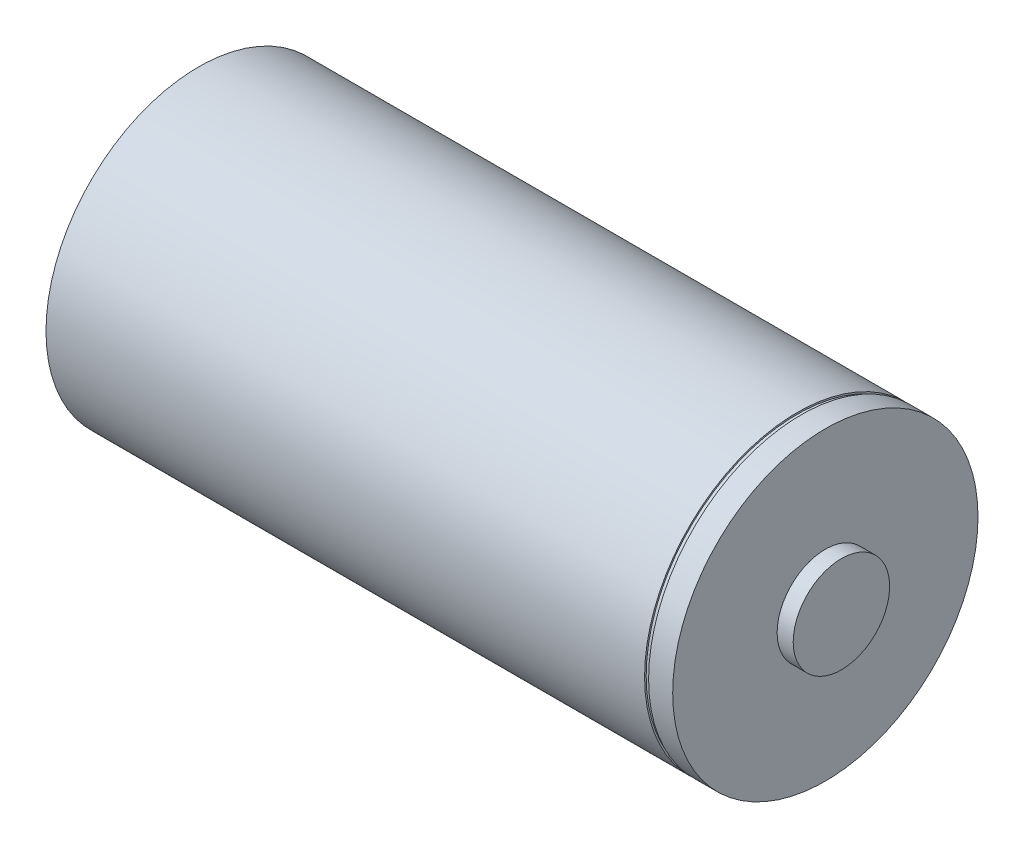
ISO-10303-21;
HEADER;
FILE_DESCRIPTION(('STEP AP214'),'2;1');
FILE_NAME('part.step','',(''),(''),'','','');
FILE_SCHEMA(('AUTOMOTIVE_DESIGN { 1 0 10303 214 1 1 1 1 }'));
ENDSEC;
DATA;
#1=APPLICATION_CONTEXT('core data for automotive mechanical design processes');
#2=APPLICATION_PROTOCOL_DEFINITION('international standard','automotive_design',2000,#1);
#3=PRODUCT_CONTEXT('',#1,'mechanical');
#4=PRODUCT('Part','Part','',(#3));
#5=PRODUCT_RELATED_PRODUCT_CATEGORY('part','',(#4));
#6=PRODUCT_DEFINITION_FORMATION('','',#4);
#7=PRODUCT_DEFINITION_CONTEXT('part definition',#1,'design');
#8=PRODUCT_DEFINITION('design','',#6,#7);
#9=PRODUCT_DEFINITION_SHAPE('','',#8);
#10=(LENGTH_UNIT() NAMED_UNIT(*) SI_UNIT(.MILLI.,.METRE.));
#11=(NAMED_UNIT(*) PLANE_ANGLE_UNIT() SI_UNIT($,.RADIAN.));
#12=(NAMED_UNIT(*) SI_UNIT($,.STERADIAN.) SOLID_ANGLE_UNIT());
#13=UNCERTAINTY_MEASURE_WITH_UNIT(LENGTH_MEASURE(1.E-05),#10,'distance_accuracy_value','');
#14=(GEOMETRIC_REPRESENTATION_CONTEXT(3) GLOBAL_UNCERTAINTY_ASSIGNED_CONTEXT((#13)) GLOBAL_UNIT_ASSIGNED_CONTEXT((#10,
#11,#12)) REPRESENTATION_CONTEXT('',''));
#15=CARTESIAN_POINT('',(0.,0.,0.));
#16=DIRECTION('',(0.,0.,1.));
#17=DIRECTION('',(1.,0.,0.));
#18=AXIS2_PLACEMENT_3D('',#15,#16,#17);
#19=CARTESIAN_POINT('',(0.,0.,0.));
#20=DIRECTION('',(-1.,0.,0.));
#21=DIRECTION('',(0.,0.,1.00000000000001));
#22=AXIS2_PLACEMENT_3D('',#19,#20,#21);
#23=CYLINDRICAL_SURFACE('',#22,19.);
#24=CARTESIAN_POINT('',(78.,0.,0.));
#25=DIRECTION('',(-1.,0.,0.));
#26=DIRECTION('',(0.,0.,1.00000000000001));
#27=AXIS2_PLACEMENT_3D('',#24,#25,#26);
#28=CIRCLE('',#27,19.);
#29=CARTESIAN_POINT('',(78.,0.,19.0000000000002));
#30=VERTEX_POINT('',#29);
#31=EDGE_CURVE('E44',#30,#30,#28,.T.);
#32=ORIENTED_EDGE('',*,*,#31,.T.);
#33=EDGE_LOOP('',(#32));
#34=FACE_BOUND('',#33,.T.);
#35=CARTESIAN_POINT('',(75.,0.,0.));
#36=DIRECTION('',(-1.,0.,0.));
#37=DIRECTION('',(0.,0.,1.00000000000001));
#38=AXIS2_PLACEMENT_3D('',#35,#36,#37);
#39=CIRCLE('',#38,19.);
#40=CARTESIAN_POINT('',(75.,0.,19.0000000000002));
#41=VERTEX_POINT('',#40);
#42=EDGE_CURVE('E70',#41,#41,#39,.T.);
#43=ORIENTED_EDGE('',*,*,#42,.F.);
#44=EDGE_LOOP('',(#43));
#45=FACE_BOUND('',#44,.T.);
#46=ADVANCED_FACE('F36',(#34,#45),#23,.T.);
#47=CARTESIAN_POINT('',(77.9999999999999,19.0000000000002,0.));
#48=DIRECTION('',(-1.,0.,0.));
#49=DIRECTION('',(0.,0.,1.00000000000001));
#50=AXIS2_PLACEMENT_3D('',#47,#48,#49);
#51=PLANE('',#50);
#52=ORIENTED_EDGE('',*,*,#31,.F.);
#53=EDGE_LOOP('',(#52));
#54=FACE_BOUND('',#53,.T.);
#55=CARTESIAN_POINT('',(78.,0.,0.));
#56=DIRECTION('',(-1.,0.,0.));
#57=DIRECTION('',(0.,0.,1.00000000000001));
#58=AXIS2_PLACEMENT_3D('',#55,#56,#57);
#59=CIRCLE('',#58,6.);
#60=CARTESIAN_POINT('',(78.,0.,6.00000000000005));
#61=VERTEX_POINT('',#60);
#62=EDGE_CURVE('E50',#61,#61,#59,.T.);
#63=ORIENTED_EDGE('',*,*,#62,.T.);
#64=EDGE_LOOP('',(#63));
#65=FACE_BOUND('',#64,.T.);
#66=ADVANCED_FACE('F99',(#54,#65),#51,.F.);
#67=CARTESIAN_POINT('',(0.,0.,0.));
#68=DIRECTION('',(-1.,0.,0.));
#69=DIRECTION('',(0.,0.,1.00000000000001));
#70=AXIS2_PLACEMENT_3D('',#67,#68,#69);
#71=CYLINDRICAL_SURFACE('',#70,6.);
#72=ORIENTED_EDGE('',*,*,#62,.F.);
#73=EDGE_LOOP('',(#72));
#74=FACE_BOUND('',#73,.T.);
#75=CARTESIAN_POINT('',(80.,-1.10588621593521E-13,0.));
#76=DIRECTION('',(-1.,0.,0.));
#77=DIRECTION('',(0.,0.,1.00000000000001));
#78=AXIS2_PLACEMENT_3D('',#75,#76,#77);
#79=CIRCLE('',#78,6.);
#80=CARTESIAN_POINT('',(80.,-1.10921688500909E-13,6.00000000000005));
#81=VERTEX_POINT('',#80);
#82=EDGE_CURVE('E56',#81,#81,#79,.T.);
#83=ORIENTED_EDGE('',*,*,#82,.T.);
#84=EDGE_LOOP('',(#83));
#85=FACE_BOUND('',#84,.T.);
#86=ADVANCED_FACE('F95',(#74,#85),#71,.T.);
#87=CARTESIAN_POINT('',(80.,6.00000000000005,0.));
#88=DIRECTION('',(-1.,0.,0.));
#89=DIRECTION('',(0.,0.,1.00000000000001));
#90=AXIS2_PLACEMENT_3D('',#87,#88,#89);
#91=PLANE('',#90);
#92=ORIENTED_EDGE('',*,*,#82,.F.);
#93=EDGE_LOOP('',(#92));
#94=FACE_BOUND('',#93,.T.);
#95=ADVANCED_FACE('F85',(#94),#91,.F.);
#96=CARTESIAN_POINT('',(74.4999999999999,19.0000000000002,0.));
#97=DIRECTION('',(1.,0.,0.));
#98=DIRECTION('',(0.,0.,-1.00000000000001));
#99=AXIS2_PLACEMENT_3D('',#96,#97,#98);
#100=PLANE('',#99);
#101=CARTESIAN_POINT('',(74.5,0.,0.));
#102=DIRECTION('',(-1.,0.,0.));
#103=DIRECTION('',(0.,0.,1.00000000000001));
#104=AXIS2_PLACEMENT_3D('',#101,#102,#103);
#105=CIRCLE('',#104,18.8);
#106=CARTESIAN_POINT('',(74.5,0.,18.8000000000002));
#107=VERTEX_POINT('',#106);
#108=EDGE_CURVE('E62',#107,#107,#105,.T.);
#109=ORIENTED_EDGE('',*,*,#108,.T.);
#110=EDGE_LOOP('',(#109));
#111=FACE_BOUND('',#110,.T.);
#112=CARTESIAN_POINT('',(74.5,0.,0.));
#113=DIRECTION('',(-1.,0.,0.));
#114=DIRECTION('',(0.,0.,1.00000000000001));
#115=AXIS2_PLACEMENT_3D('',#112,#113,#114);
#116=CIRCLE('',#115,19.);
#117=CARTESIAN_POINT('',(74.5,0.,19.0000000000002));
#118=VERTEX_POINT('',#117);
#119=EDGE_CURVE('E74',#118,#118,#116,.T.);
#120=ORIENTED_EDGE('',*,*,#119,.F.);
#121=EDGE_LOOP('',(#120));
#122=FACE_BOUND('',#121,.T.);
#123=ADVANCED_FACE('F82',(#111,#122),#100,.T.);
#124=CARTESIAN_POINT('',(0.,0.,0.));
#125=DIRECTION('',(-1.,0.,0.));
#126=DIRECTION('',(0.,0.,1.00000000000001));
#127=AXIS2_PLACEMENT_3D('',#124,#125,#126);
#128=CYLINDRICAL_SURFACE('',#127,18.8);
#129=CARTESIAN_POINT('',(75.,0.,0.));
#130=DIRECTION('',(-1.,0.,0.));
#131=DIRECTION('',(0.,0.,1.00000000000001));
#132=AXIS2_PLACEMENT_3D('',#129,#130,#131);
#133=CIRCLE('',#132,18.8);
#134=CARTESIAN_POINT('',(75.,0.,18.8000000000002));
#135=VERTEX_POINT('',#134);
#136=EDGE_CURVE('E66',#135,#135,#133,.T.);
#137=ORIENTED_EDGE('',*,*,#136,.T.);
#138=EDGE_LOOP('',(#137));
#139=FACE_BOUND('',#138,.T.);
#140=ORIENTED_EDGE('',*,*,#108,.F.);
#141=EDGE_LOOP('',(#140));
#142=FACE_BOUND('',#141,.T.);
#143=ADVANCED_FACE('F84',(#139,#142),#128,.T.);
#144=CARTESIAN_POINT('',(74.9999999999999,19.0000000000001,0.));
#145=DIRECTION('',(-1.,0.,0.));
#146=DIRECTION('',(0.,0.,1.00000000000001));
#147=AXIS2_PLACEMENT_3D('',#144,#145,#146);
#148=PLANE('',#147);
#149=ORIENTED_EDGE('',*,*,#42,.T.);
#150=EDGE_LOOP('',(#149));
#151=FACE_BOUND('',#150,.T.);
#152=ORIENTED_EDGE('',*,*,#136,.F.);
#153=EDGE_LOOP('',(#152));
#154=FACE_BOUND('',#153,.T.);
#155=ADVANCED_FACE('F92',(#151,#154),#148,.T.);
#156=CARTESIAN_POINT('',(0.,0.,0.));
#157=DIRECTION('',(1.,0.,0.));
#158=DIRECTION('',(0.,0.,-1.00000000000001));
#159=AXIS2_PLACEMENT_3D('',#156,#157,#158);
#160=PLANE('',#159);
#161=CARTESIAN_POINT('',(0.,0.,0.));
#162=DIRECTION('',(-1.,0.,0.));
#163=DIRECTION('',(0.,0.,1.00000000000001));
#164=AXIS2_PLACEMENT_3D('',#161,#162,#163);
#165=CIRCLE('',#164,19.);
#166=CARTESIAN_POINT('',(0.,0.,19.0000000000002));
#167=VERTEX_POINT('',#166);
#168=EDGE_CURVE('E10',#167,#167,#165,.T.);
#169=ORIENTED_EDGE('',*,*,#168,.T.);
#170=EDGE_LOOP('',(#169));
#171=FACE_BOUND('',#170,.T.);
#172=ADVANCED_FACE('F38',(#171),#160,.F.);
#173=ORIENTED_EDGE('',*,*,#168,.F.);
#174=EDGE_LOOP('',(#173));
#175=FACE_BOUND('',#174,.T.);
#176=ORIENTED_EDGE('',*,*,#119,.T.);
#177=EDGE_LOOP('',(#176));
#178=FACE_BOUND('',#177,.T.);
#179=ADVANCED_FACE('F80',(#175,#178),#23,.T.);
#180=CLOSED_SHELL('',(#46,#66,#86,#95,#123,#143,#155,#172,#179));
#181=MANIFOLD_SOLID_BREP('B2',#180);
#182=ADVANCED_BREP_SHAPE_REPRESENTATION('',(#18,#181),#14);
#183=SHAPE_DEFINITION_REPRESENTATION(#9,#182);
ENDSEC;
END-ISO-10303-21;
